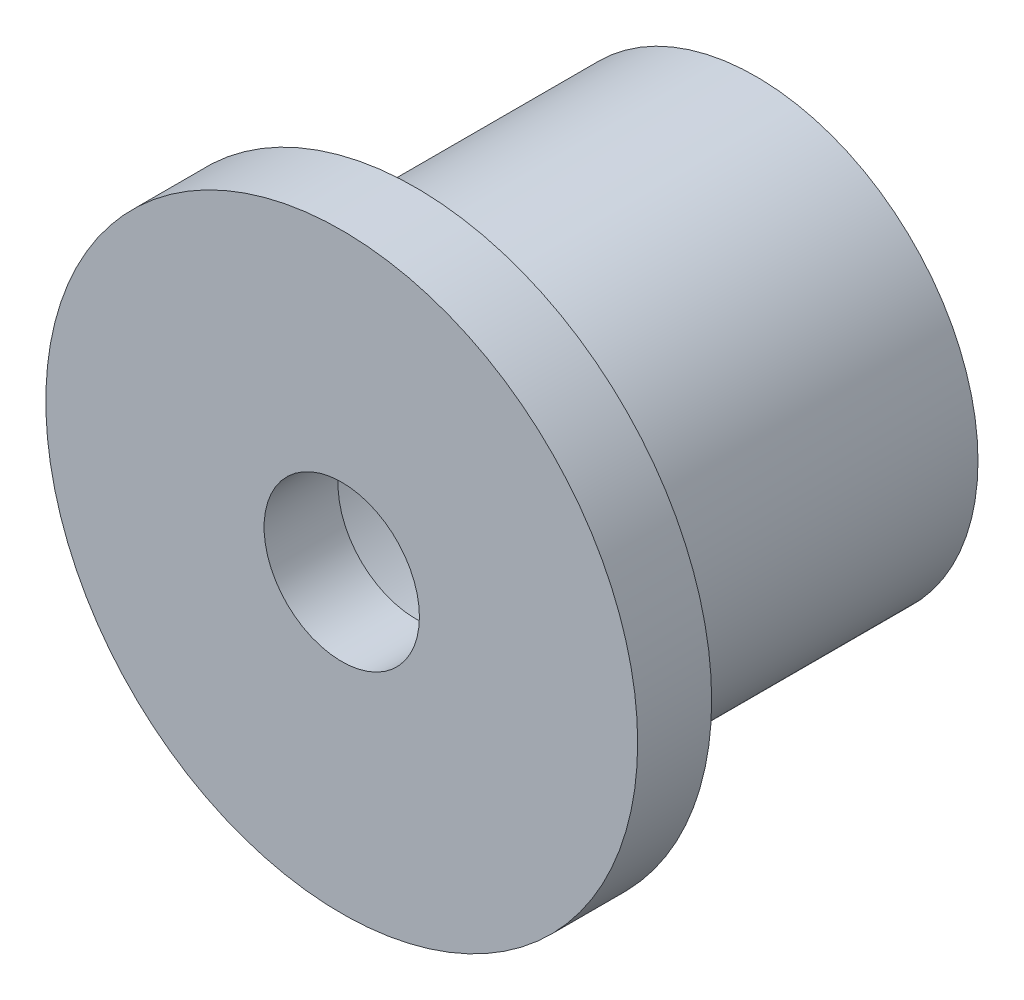
ISO-10303-21;
HEADER;
FILE_DESCRIPTION(('STEP AP214'),'2;1');
FILE_NAME('part.step','',(''),(''),'','','');
FILE_SCHEMA(('AUTOMOTIVE_DESIGN { 1 0 10303 214 1 1 1 1 }'));
ENDSEC;
DATA;
#1=APPLICATION_CONTEXT('core data for automotive mechanical design processes');
#2=APPLICATION_PROTOCOL_DEFINITION('international standard','automotive_design',2000,#1);
#3=PRODUCT_CONTEXT('',#1,'mechanical');
#4=PRODUCT('Part','Part','',(#3));
#5=PRODUCT_RELATED_PRODUCT_CATEGORY('part','',(#4));
#6=PRODUCT_DEFINITION_FORMATION('','',#4);
#7=PRODUCT_DEFINITION_CONTEXT('part definition',#1,'design');
#8=PRODUCT_DEFINITION('design','',#6,#7);
#9=PRODUCT_DEFINITION_SHAPE('','',#8);
#10=(LENGTH_UNIT() NAMED_UNIT(*) SI_UNIT(.MILLI.,.METRE.));
#11=(NAMED_UNIT(*) PLANE_ANGLE_UNIT() SI_UNIT($,.RADIAN.));
#12=(NAMED_UNIT(*) SI_UNIT($,.STERADIAN.) SOLID_ANGLE_UNIT());
#13=UNCERTAINTY_MEASURE_WITH_UNIT(LENGTH_MEASURE(1.E-05),#10,'distance_accuracy_value','');
#14=(GEOMETRIC_REPRESENTATION_CONTEXT(3) GLOBAL_UNCERTAINTY_ASSIGNED_CONTEXT((#13)) GLOBAL_UNIT_ASSIGNED_CONTEXT((#10,
#11,#12)) REPRESENTATION_CONTEXT('',''));
#15=CARTESIAN_POINT('',(0.,0.,0.));
#16=DIRECTION('',(0.,0.,1.));
#17=DIRECTION('',(1.,0.,0.));
#18=AXIS2_PLACEMENT_3D('',#15,#16,#17);
#19=CARTESIAN_POINT('',(0.,15.,0.));
#20=DIRECTION('',(0.,0.,1.));
#21=DIRECTION('',(1.,0.,0.));
#22=AXIS2_PLACEMENT_3D('',#19,#20,#21);
#23=PLANE('',#22);
#24=CARTESIAN_POINT('',(0.,0.,1.11022302462516E-13));
#25=DIRECTION('',(0.,0.,1.));
#26=DIRECTION('',(1.,0.,0.));
#27=AXIS2_PLACEMENT_3D('',#24,#25,#26);
#28=CIRCLE('',#27,15.);
#29=CARTESIAN_POINT('',(15.,0.,1.11022302462516E-13));
#30=VERTEX_POINT('',#29);
#31=EDGE_CURVE('E62',#30,#30,#28,.T.);
#32=ORIENTED_EDGE('',*,*,#31,.F.);
#33=EDGE_LOOP('',(#32));
#34=FACE_BOUND('',#33,.T.);
#35=CARTESIAN_POINT('',(0.,0.,1.11022302462516E-13));
#36=DIRECTION('',(0.,0.,1.));
#37=DIRECTION('',(1.,0.,0.));
#38=AXIS2_PLACEMENT_3D('',#35,#36,#37);
#39=CIRCLE('',#38,12.5);
#40=CARTESIAN_POINT('',(12.5,0.,1.11022302462516E-13));
#41=VERTEX_POINT('',#40);
#42=EDGE_CURVE('E10',#41,#41,#39,.T.);
#43=ORIENTED_EDGE('',*,*,#42,.T.);
#44=EDGE_LOOP('',(#43));
#45=FACE_BOUND('',#44,.T.);
#46=ADVANCED_FACE('F34',(#34,#45),#23,.F.);
#47=CARTESIAN_POINT('',(0.,0.,1000.));
#48=DIRECTION('',(0.,0.,1.));
#49=DIRECTION('',(1.,0.,0.));
#50=AXIS2_PLACEMENT_3D('',#47,#48,#49);
#51=CYLINDRICAL_SURFACE('',#50,12.5);
#52=ORIENTED_EDGE('',*,*,#42,.F.);
#53=EDGE_LOOP('',(#52));
#54=FACE_BOUND('',#53,.T.);
#55=CARTESIAN_POINT('',(0.,0.,23.0000000000001));
#56=DIRECTION('',(0.,0.,1.));
#57=DIRECTION('',(1.,0.,0.));
#58=AXIS2_PLACEMENT_3D('',#55,#56,#57);
#59=CIRCLE('',#58,12.5);
#60=CARTESIAN_POINT('',(12.5,0.,23.0000000000001));
#61=VERTEX_POINT('',#60);
#62=EDGE_CURVE('E40',#61,#61,#59,.T.);
#63=ORIENTED_EDGE('',*,*,#62,.T.);
#64=EDGE_LOOP('',(#63));
#65=FACE_BOUND('',#64,.T.);
#66=ADVANCED_FACE('F69',(#54,#65),#51,.F.);
#67=CARTESIAN_POINT('',(0.,12.5,23.0000000000001));
#68=DIRECTION('',(0.,0.,1.));
#69=DIRECTION('',(1.,0.,0.));
#70=AXIS2_PLACEMENT_3D('',#67,#68,#69);
#71=PLANE('',#70);
#72=ORIENTED_EDGE('',*,*,#62,.F.);
#73=EDGE_LOOP('',(#72));
#74=FACE_BOUND('',#73,.T.);
#75=CARTESIAN_POINT('',(0.,0.,23.0000000000001));
#76=DIRECTION('',(0.,0.,1.));
#77=DIRECTION('',(1.,0.,0.));
#78=AXIS2_PLACEMENT_3D('',#75,#76,#77);
#79=CIRCLE('',#78,5.25);
#80=CARTESIAN_POINT('',(5.25,0.,23.0000000000001));
#81=VERTEX_POINT('',#80);
#82=EDGE_CURVE('E44',#81,#81,#79,.T.);
#83=ORIENTED_EDGE('',*,*,#82,.T.);
#84=EDGE_LOOP('',(#83));
#85=FACE_BOUND('',#84,.T.);
#86=ADVANCED_FACE('F73',(#74,#85),#71,.F.);
#87=CARTESIAN_POINT('',(0.,0.,1000.));
#88=DIRECTION('',(0.,0.,1.));
#89=DIRECTION('',(1.,0.,0.));
#90=AXIS2_PLACEMENT_3D('',#87,#88,#89);
#91=CYLINDRICAL_SURFACE('',#90,5.25);
#92=ORIENTED_EDGE('',*,*,#82,.F.);
#93=EDGE_LOOP('',(#92));
#94=FACE_BOUND('',#93,.T.);
#95=CARTESIAN_POINT('',(0.,0.,28.));
#96=DIRECTION('',(0.,0.,1.));
#97=DIRECTION('',(1.,0.,0.));
#98=AXIS2_PLACEMENT_3D('',#95,#96,#97);
#99=CIRCLE('',#98,5.25);
#100=CARTESIAN_POINT('',(5.25,0.,28.));
#101=VERTEX_POINT('',#100);
#102=EDGE_CURVE('E48',#101,#101,#99,.T.);
#103=ORIENTED_EDGE('',*,*,#102,.T.);
#104=EDGE_LOOP('',(#103));
#105=FACE_BOUND('',#104,.T.);
#106=ADVANCED_FACE('F78',(#94,#105),#91,.F.);
#107=CARTESIAN_POINT('',(0.,5.25,28.0000000000001));
#108=DIRECTION('',(0.,0.,-1.));
#109=DIRECTION('',(-1.,0.,0.));
#110=AXIS2_PLACEMENT_3D('',#107,#108,#109);
#111=PLANE('',#110);
#112=ORIENTED_EDGE('',*,*,#102,.F.);
#113=EDGE_LOOP('',(#112));
#114=FACE_BOUND('',#113,.T.);
#115=CARTESIAN_POINT('',(0.,0.,28.));
#116=DIRECTION('',(0.,0.,1.));
#117=DIRECTION('',(1.,0.,0.));
#118=AXIS2_PLACEMENT_3D('',#115,#116,#117);
#119=CIRCLE('',#118,20.);
#120=CARTESIAN_POINT('',(20.,0.,28.));
#121=VERTEX_POINT('',#120);
#122=EDGE_CURVE('E53',#121,#121,#119,.T.);
#123=ORIENTED_EDGE('',*,*,#122,.T.);
#124=EDGE_LOOP('',(#123));
#125=FACE_BOUND('',#124,.T.);
#126=ADVANCED_FACE('F84',(#114,#125),#111,.F.);
#127=CARTESIAN_POINT('',(0.,0.,1000.));
#128=DIRECTION('',(0.,0.,1.));
#129=DIRECTION('',(1.,0.,0.));
#130=AXIS2_PLACEMENT_3D('',#127,#128,#129);
#131=CYLINDRICAL_SURFACE('',#130,20.);
#132=ORIENTED_EDGE('',*,*,#122,.F.);
#133=EDGE_LOOP('',(#132));
#134=FACE_BOUND('',#133,.T.);
#135=CARTESIAN_POINT('',(0.,0.,23.0000000000001));
#136=DIRECTION('',(0.,0.,1.));
#137=DIRECTION('',(1.,0.,0.));
#138=AXIS2_PLACEMENT_3D('',#135,#136,#137);
#139=CIRCLE('',#138,20.);
#140=CARTESIAN_POINT('',(20.,0.,23.0000000000001));
#141=VERTEX_POINT('',#140);
#142=EDGE_CURVE('E56',#141,#141,#139,.T.);
#143=ORIENTED_EDGE('',*,*,#142,.T.);
#144=EDGE_LOOP('',(#143));
#145=FACE_BOUND('',#144,.T.);
#146=ADVANCED_FACE('F88',(#134,#145),#131,.T.);
#147=CARTESIAN_POINT('',(0.,20.,23.0000000000001));
#148=DIRECTION('',(0.,0.,1.));
#149=DIRECTION('',(1.,0.,0.));
#150=AXIS2_PLACEMENT_3D('',#147,#148,#149);
#151=PLANE('',#150);
#152=ORIENTED_EDGE('',*,*,#142,.F.);
#153=EDGE_LOOP('',(#152));
#154=FACE_BOUND('',#153,.T.);
#155=CARTESIAN_POINT('',(0.,0.,23.0000000000001));
#156=DIRECTION('',(0.,0.,1.));
#157=DIRECTION('',(1.,0.,0.));
#158=AXIS2_PLACEMENT_3D('',#155,#156,#157);
#159=CIRCLE('',#158,15.);
#160=CARTESIAN_POINT('',(15.,0.,23.0000000000001));
#161=VERTEX_POINT('',#160);
#162=EDGE_CURVE('E59',#161,#161,#159,.T.);
#163=ORIENTED_EDGE('',*,*,#162,.T.);
#164=EDGE_LOOP('',(#163));
#165=FACE_BOUND('',#164,.T.);
#166=ADVANCED_FACE('F92',(#154,#165),#151,.F.);
#167=CARTESIAN_POINT('',(0.,0.,1000.));
#168=DIRECTION('',(0.,0.,1.));
#169=DIRECTION('',(1.,0.,0.));
#170=AXIS2_PLACEMENT_3D('',#167,#168,#169);
#171=CYLINDRICAL_SURFACE('',#170,15.);
#172=ORIENTED_EDGE('',*,*,#162,.F.);
#173=EDGE_LOOP('',(#172));
#174=FACE_BOUND('',#173,.T.);
#175=ORIENTED_EDGE('',*,*,#31,.T.);
#176=EDGE_LOOP('',(#175));
#177=FACE_BOUND('',#176,.T.);
#178=ADVANCED_FACE('F66',(#174,#177),#171,.T.);
#179=CLOSED_SHELL('',(#46,#66,#86,#106,#126,#146,#166,#178));
#180=MANIFOLD_SOLID_BREP('B2',#179);
#181=ADVANCED_BREP_SHAPE_REPRESENTATION('',(#18,#180),#14);
#182=SHAPE_DEFINITION_REPRESENTATION(#9,#181);
ENDSEC;
END-ISO-10303-21;
